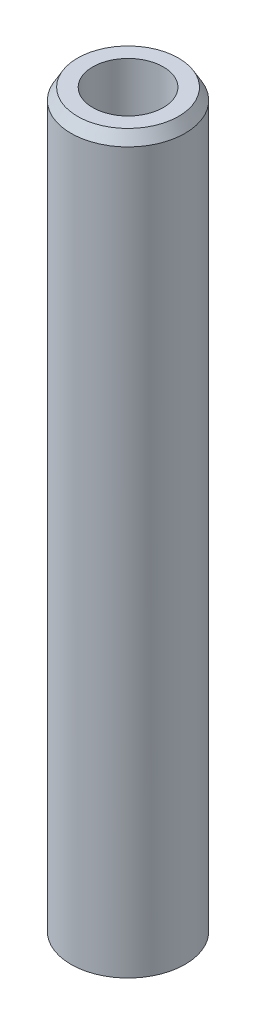
ISO-10303-21;
HEADER;
FILE_DESCRIPTION(('STEP AP214'),'2;1');
FILE_NAME('part.step','',(''),(''),'','','');
FILE_SCHEMA(('AUTOMOTIVE_DESIGN { 1 0 10303 214 1 1 1 1 }'));
ENDSEC;
DATA;
#1=APPLICATION_CONTEXT('core data for automotive mechanical design processes');
#2=APPLICATION_PROTOCOL_DEFINITION('international standard','automotive_design',2000,#1);
#3=PRODUCT_CONTEXT('',#1,'mechanical');
#4=PRODUCT('Part','Part','',(#3));
#5=PRODUCT_RELATED_PRODUCT_CATEGORY('part','',(#4));
#6=PRODUCT_DEFINITION_FORMATION('','',#4);
#7=PRODUCT_DEFINITION_CONTEXT('part definition',#1,'design');
#8=PRODUCT_DEFINITION('design','',#6,#7);
#9=PRODUCT_DEFINITION_SHAPE('','',#8);
#10=(LENGTH_UNIT() NAMED_UNIT(*) SI_UNIT(.MILLI.,.METRE.));
#11=(NAMED_UNIT(*) PLANE_ANGLE_UNIT() SI_UNIT($,.RADIAN.));
#12=(NAMED_UNIT(*) SI_UNIT($,.STERADIAN.) SOLID_ANGLE_UNIT());
#13=UNCERTAINTY_MEASURE_WITH_UNIT(LENGTH_MEASURE(1.E-05),#10,'distance_accuracy_value','');
#14=(GEOMETRIC_REPRESENTATION_CONTEXT(3) GLOBAL_UNCERTAINTY_ASSIGNED_CONTEXT((#13)) GLOBAL_UNIT_ASSIGNED_CONTEXT((#10,
#11,#12)) REPRESENTATION_CONTEXT('',''));
#15=CARTESIAN_POINT('',(0.,0.,0.));
#16=DIRECTION('',(0.,0.,1.));
#17=DIRECTION('',(1.,0.,0.));
#18=AXIS2_PLACEMENT_3D('',#15,#16,#17);
#19=CARTESIAN_POINT('',(0.,323.019459307556,0.));
#20=DIRECTION('',(0.,-1.,0.));
#21=DIRECTION('',(0.,0.,-1.));
#22=AXIS2_PLACEMENT_3D('',#19,#20,#21);
#23=CYLINDRICAL_SURFACE('',#22,25.);
#24=CARTESIAN_POINT('',(0.,318.032994780274,0.));
#25=DIRECTION('',(0.,1.,0.));
#26=DIRECTION('',(0.,0.,1.));
#27=AXIS2_PLACEMENT_3D('',#24,#25,#26);
#28=CIRCLE('',#27,25.);
#29=CARTESIAN_POINT('',(0.,318.032994780274,-25.));
#30=VERTEX_POINT('',#29);
#31=EDGE_CURVE('E50',#30,#30,#28,.F.);
#32=CARTESIAN_POINT('',(0.,2.87893663713046,0.));
#33=DIRECTION('',(0.,1.,0.));
#34=DIRECTION('',(0.,0.,1.));
#35=AXIS2_PLACEMENT_3D('',#32,#33,#34);
#36=CIRCLE('',#35,25.);
#37=CARTESIAN_POINT('',(0.,2.8789366371304,-25.));
#38=VERTEX_POINT('',#37);
#39=EDGE_CURVE('E51',#38,#38,#36,.T.);
#40=CARTESIAN_POINT('',(0.,318.032994780274,-25.));
#41=CARTESIAN_POINT('',(0.,314.75014000795,-25.));
#42=CARTESIAN_POINT('',(0.,311.467285235626,-25.));
#43=CARTESIAN_POINT('',(0.,304.901575690977,-25.));
#44=CARTESIAN_POINT('',(0.,301.618720918652,-25.));
#45=CARTESIAN_POINT('',(0.,295.053011374003,-25.));
#46=CARTESIAN_POINT('',(0.,291.770156601679,-25.));
#47=CARTESIAN_POINT('',(0.,285.20444705703,-25.));
#48=CARTESIAN_POINT('',(0.,281.921592284706,-25.));
#49=CARTESIAN_POINT('',(0.,275.355882740057,-25.));
#50=CARTESIAN_POINT('',(0.,272.073027967733,-25.));
#51=CARTESIAN_POINT('',(0.,265.507318423084,-25.));
#52=CARTESIAN_POINT('',(0.,262.224463650759,-25.));
#53=CARTESIAN_POINT('',(0.,255.65875410611,-25.));
#54=CARTESIAN_POINT('',(0.,252.375899333786,-25.));
#55=CARTESIAN_POINT('',(0.,245.810189789137,-25.));
#56=CARTESIAN_POINT('',(0.,242.527335016813,-25.));
#57=CARTESIAN_POINT('',(0.,235.961625472164,-25.));
#58=CARTESIAN_POINT('',(0.,232.67877069984,-25.));
#59=CARTESIAN_POINT('',(0.,226.113061155191,-25.));
#60=CARTESIAN_POINT('',(0.,222.830206382866,-25.));
#61=CARTESIAN_POINT('',(0.,216.264496838217,-25.));
#62=CARTESIAN_POINT('',(0.,212.981642065893,-25.));
#63=CARTESIAN_POINT('',(0.,206.415932521244,-25.));
#64=CARTESIAN_POINT('',(0.,203.13307774892,-25.));
#65=CARTESIAN_POINT('',(0.,196.567368204271,-25.));
#66=CARTESIAN_POINT('',(0.,193.284513431947,-25.));
#67=CARTESIAN_POINT('',(0.,186.718803887298,-25.));
#68=CARTESIAN_POINT('',(0.,183.435949114973,-25.));
#69=CARTESIAN_POINT('',(0.,176.870239570324,-25.));
#70=CARTESIAN_POINT('',(0.,173.587384798,-25.));
#71=CARTESIAN_POINT('',(0.,167.021675253351,-25.));
#72=CARTESIAN_POINT('',(0.,163.738820481027,-25.));
#73=CARTESIAN_POINT('',(0.,157.173110936378,-25.));
#74=CARTESIAN_POINT('',(0.,153.890256164054,-25.));
#75=CARTESIAN_POINT('',(0.,147.324546619405,-25.));
#76=CARTESIAN_POINT('',(0.,144.04169184708,-25.));
#77=CARTESIAN_POINT('',(0.,137.475982302432,-25.));
#78=CARTESIAN_POINT('',(0.,134.193127530107,-25.));
#79=CARTESIAN_POINT('',(0.,127.627417985458,-25.));
#80=CARTESIAN_POINT('',(0.,124.344563213134,-25.));
#81=CARTESIAN_POINT('',(0.,117.778853668485,-25.));
#82=CARTESIAN_POINT('',(0.,114.495998896161,-25.));
#83=CARTESIAN_POINT('',(0.,107.930289351512,-25.));
#84=CARTESIAN_POINT('',(0.,104.647434579187,-25.));
#85=CARTESIAN_POINT('',(0.,98.0817250345385,-25.));
#86=CARTESIAN_POINT('',(0.,94.7988702622141,-25.));
#87=CARTESIAN_POINT('',(0.,88.2331607175653,-25.));
#88=CARTESIAN_POINT('',(0.,84.9503059452408,-25.));
#89=CARTESIAN_POINT('',(0.,78.384596400592,-25.));
#90=CARTESIAN_POINT('',(0.,75.1017416282676,-25.));
#91=CARTESIAN_POINT('',(0.,68.5360320836187,-25.));
#92=CARTESIAN_POINT('',(0.,65.2531773112943,-25.));
#93=CARTESIAN_POINT('',(0.,58.6874677666455,-25.));
#94=CARTESIAN_POINT('',(0.,55.4046129943211,-25.));
#95=CARTESIAN_POINT('',(0.,48.8389034496723,-25.));
#96=CARTESIAN_POINT('',(0.,45.5560486773478,-25.));
#97=CARTESIAN_POINT('',(0.,38.990339132699,-25.));
#98=CARTESIAN_POINT('',(0.,35.7074843603746,-25.));
#99=CARTESIAN_POINT('',(0.,29.1417748157258,-25.));
#100=CARTESIAN_POINT('',(0.,25.8589200434014,-25.));
#101=CARTESIAN_POINT('',(0.,19.2932104987525,-25.));
#102=CARTESIAN_POINT('',(0.,16.0103557264281,-25.));
#103=CARTESIAN_POINT('',(0.,9.44464618177922,-25.));
#104=CARTESIAN_POINT('',(0.,6.16179140945481,-25.));
#105=CARTESIAN_POINT('',(0.,2.8789366371304,-25.));
#106=B_SPLINE_CURVE_WITH_KNOTS('',3,(#40,#41,#42,#43,#44,#45,#46,#47,#48,#49,#50,#51,#52,#53,
#54,#55,#56,#57,#58,#59,#60,#61,#62,#63,#64,#65,#66,#67,#68,#69,#70,#71,#72,#73,#74,#75,#76,#77,
#78,#79,#80,#81,#82,#83,#84,#85,#86,#87,#88,#89,#90,#91,#92,#93,#94,#95,#96,#97,#98,#99,#100,
#101,#102,#103,#104,#105),.UNSPECIFIED.,.F.,.F.,(4,2,2,2,2,2,2,2,2,2,2,2,2,2,2,2,2,2,2,2,2,2,2,
2,2,2,2,2,2,2,2,2,4),(0.,9.84856431697328,19.6971286339465,29.5456929509197,39.394257267893,
49.2428215848663,59.0913859018395,68.9399502188128,78.788514535786,88.6370788527593,
98.4856431697325,108.334207486706,118.182771803679,128.031336120652,137.879900437625,
147.728464754599,157.577029071572,167.425593388545,177.274157705519,187.122722022492,
196.971286339465,206.819850656438,216.668414973412,226.516979290385,236.365543607358,
246.214107924331,256.062672241305,265.911236558278,275.759800875251,285.608365192224,
295.456929509197,305.305493826171,315.154058143144),.UNSPECIFIED.);
#107=EDGE_CURVE('BSEAM39',#30,#38,#106,.T.);
#108=ORIENTED_EDGE('',*,*,#31,.T.);
#109=ORIENTED_EDGE('',*,*,#39,.T.);
#110=ORIENTED_EDGE('',*,*,#107,.T.);
#111=ORIENTED_EDGE('',*,*,#107,.F.);
#112=EDGE_LOOP('',(#108,#110,#109,#111));
#113=FACE_BOUND('',#112,.T.);
#114=ADVANCED_FACE('F39',(#113),#23,.T.);
#115=CARTESIAN_POINT('',(0.,323.019459307556,0.));
#116=DIRECTION('',(0.,1.,0.));
#117=DIRECTION('',(0.,0.,1.));
#118=AXIS2_PLACEMENT_3D('',#115,#116,#117);
#119=PLANE('',#118);
#120=CARTESIAN_POINT('',(0.,323.019459307556,0.));
#121=DIRECTION('',(0.,1.,0.));
#122=DIRECTION('',(0.,0.,1.));
#123=AXIS2_PLACEMENT_3D('',#120,#121,#122);
#124=CIRCLE('',#123,22.1210633628698);
#125=CARTESIAN_POINT('',(0.,323.019459307555,-22.1210633628698));
#126=VERTEX_POINT('',#125);
#127=EDGE_CURVE('E54',#126,#126,#124,.T.);
#128=ORIENTED_EDGE('',*,*,#127,.T.);
#129=EDGE_LOOP('',(#128));
#130=FACE_BOUND('',#129,.T.);
#131=CARTESIAN_POINT('',(0.,323.019459307556,0.));
#132=DIRECTION('',(0.,1.,0.));
#133=DIRECTION('',(0.,0.,1.));
#134=AXIS2_PLACEMENT_3D('',#131,#132,#133);
#135=CIRCLE('',#134,15.4527713364003);
#136=CARTESIAN_POINT('',(0.,323.019459307556,-15.4527713364003));
#137=VERTEX_POINT('',#136);
#138=EDGE_CURVE('E58',#137,#137,#135,.T.);
#139=ORIENTED_EDGE('',*,*,#138,.F.);
#140=EDGE_LOOP('',(#139));
#141=FACE_BOUND('',#140,.T.);
#142=ADVANCED_FACE('F69',(#130,#141),#119,.T.);
#143=CARTESIAN_POINT('',(0.,0.,0.));
#144=DIRECTION('',(0.,1.,0.));
#145=DIRECTION('',(0.,0.,1.));
#146=AXIS2_PLACEMENT_3D('',#143,#144,#145);
#147=PLANE('',#146);
#148=CARTESIAN_POINT('',(0.,0.,0.));
#149=DIRECTION('',(0.,1.,0.));
#150=DIRECTION('',(0.,0.,1.));
#151=AXIS2_PLACEMENT_3D('',#148,#149,#150);
#152=CIRCLE('',#151,20.0135354727184);
#153=CARTESIAN_POINT('',(0.,0.,20.0135354727184));
#154=VERTEX_POINT('',#153);
#155=EDGE_CURVE('E10',#154,#154,#152,.F.);
#156=ORIENTED_EDGE('',*,*,#155,.T.);
#157=EDGE_LOOP('',(#156));
#158=FACE_BOUND('',#157,.T.);
#159=CARTESIAN_POINT('',(0.,0.,0.));
#160=DIRECTION('',(0.,1.,0.));
#161=DIRECTION('',(0.,0.,1.));
#162=AXIS2_PLACEMENT_3D('',#159,#160,#161);
#163=CIRCLE('',#162,15.4527713364003);
#164=CARTESIAN_POINT('',(0.,0.,-15.4527713364003));
#165=VERTEX_POINT('',#164);
#166=EDGE_CURVE('E63',#165,#165,#163,.T.);
#167=ORIENTED_EDGE('',*,*,#166,.T.);
#168=EDGE_LOOP('',(#167));
#169=FACE_BOUND('',#168,.T.);
#170=ADVANCED_FACE('F75',(#158,#169),#147,.F.);
#171=CARTESIAN_POINT('',(0.,323.019459307556,0.));
#172=DIRECTION('',(0.,-1.,0.));
#173=DIRECTION('',(0.,0.,-1.));
#174=AXIS2_PLACEMENT_3D('',#171,#172,#173);
#175=CYLINDRICAL_SURFACE('',#174,15.4527713364003);
#176=CARTESIAN_POINT('',(0.,323.019459307556,-15.4527713364003));
#177=CARTESIAN_POINT('',(0.,319.654673273102,-15.4527713364003));
#178=CARTESIAN_POINT('',(0.,316.289887238648,-15.4527713364003));
#179=CARTESIAN_POINT('',(0.,309.560315169741,-15.4527713364003));
#180=CARTESIAN_POINT('',(0.,306.195529135287,-15.4527713364003));
#181=CARTESIAN_POINT('',(0.,299.46595706638,-15.4527713364003));
#182=CARTESIAN_POINT('',(0.,296.101171031926,-15.4527713364003));
#183=CARTESIAN_POINT('',(0.,289.371598963018,-15.4527713364003));
#184=CARTESIAN_POINT('',(0.,286.006812928565,-15.4527713364003));
#185=CARTESIAN_POINT('',(0.,279.277240859657,-15.4527713364003));
#186=CARTESIAN_POINT('',(0.,275.912454825204,-15.4527713364003));
#187=CARTESIAN_POINT('',(0.,269.182882756296,-15.4527713364003));
#188=CARTESIAN_POINT('',(0.,265.818096721843,-15.4527713364003));
#189=CARTESIAN_POINT('',(0.,259.088524652935,-15.4527713364003));
#190=CARTESIAN_POINT('',(0.,255.723738618481,-15.4527713364003));
#191=CARTESIAN_POINT('',(0.,248.994166549574,-15.4527713364003));
#192=CARTESIAN_POINT('',(0.,245.62938051512,-15.4527713364003));
#193=CARTESIAN_POINT('',(0.,238.899808446213,-15.4527713364003));
#194=CARTESIAN_POINT('',(0.,235.535022411759,-15.4527713364003));
#195=CARTESIAN_POINT('',(0.,228.805450342852,-15.4527713364003));
#196=CARTESIAN_POINT('',(0.,225.440664308398,-15.4527713364003));
#197=CARTESIAN_POINT('',(0.,218.711092239491,-15.4527713364003));
#198=CARTESIAN_POINT('',(0.,215.346306205037,-15.4527713364003));
#199=CARTESIAN_POINT('',(0.,208.61673413613,-15.4527713364003));
#200=CARTESIAN_POINT('',(0.,205.251948101676,-15.4527713364003));
#201=CARTESIAN_POINT('',(0.,198.522376032768,-15.4527713364003));
#202=CARTESIAN_POINT('',(0.,195.157589998315,-15.4527713364003));
#203=CARTESIAN_POINT('',(0.,188.428017929407,-15.4527713364003));
#204=CARTESIAN_POINT('',(0.,185.063231894954,-15.4527713364003));
#205=CARTESIAN_POINT('',(0.,178.333659826046,-15.4527713364003));
#206=CARTESIAN_POINT('',(0.,174.968873791593,-15.4527713364003));
#207=CARTESIAN_POINT('',(0.,168.239301722685,-15.4527713364003));
#208=CARTESIAN_POINT('',(0.,164.874515688231,-15.4527713364003));
#209=CARTESIAN_POINT('',(0.,158.144943619324,-15.4527713364003));
#210=CARTESIAN_POINT('',(0.,154.78015758487,-15.4527713364003));
#211=CARTESIAN_POINT('',(0.,148.050585515963,-15.4527713364003));
#212=CARTESIAN_POINT('',(0.,144.685799481509,-15.4527713364003));
#213=CARTESIAN_POINT('',(0.,137.956227412602,-15.4527713364003));
#214=CARTESIAN_POINT('',(0.,134.591441378148,-15.4527713364003));
#215=CARTESIAN_POINT('',(0.,127.861869309241,-15.4527713364003));
#216=CARTESIAN_POINT('',(0.,124.497083274787,-15.4527713364003));
#217=CARTESIAN_POINT('',(0.,117.76751120588,-15.4527713364003));
#218=CARTESIAN_POINT('',(0.,114.402725171426,-15.4527713364003));
#219=CARTESIAN_POINT('',(0.,107.673153102518,-15.4527713364003));
#220=CARTESIAN_POINT('',(0.,104.308367068065,-15.4527713364003));
#221=CARTESIAN_POINT('',(0.,97.5787949991573,-15.4527713364003));
#222=CARTESIAN_POINT('',(0.,94.2140089647036,-15.4527713364003));
#223=CARTESIAN_POINT('',(0.,87.4844368957962,-15.4527713364003));
#224=CARTESIAN_POINT('',(0.,84.1196508613425,-15.4527713364003));
#225=CARTESIAN_POINT('',(0.,77.3900787924351,-15.4527713364003));
#226=CARTESIAN_POINT('',(0.,74.0252927579814,-15.4527713364003));
#227=CARTESIAN_POINT('',(0.,67.295720689074,-15.4527713364003));
#228=CARTESIAN_POINT('',(0.,63.9309346546203,-15.4527713364003));
#229=CARTESIAN_POINT('',(0.,57.2013625857129,-15.4527713364003));
#230=CARTESIAN_POINT('',(0.,53.8365765512592,-15.4527713364003));
#231=CARTESIAN_POINT('',(0.,47.1070044823518,-15.4527713364003));
#232=CARTESIAN_POINT('',(0.,43.7422184478981,-15.4527713364003));
#233=CARTESIAN_POINT('',(0.,37.0126463789907,-15.4527713364003));
#234=CARTESIAN_POINT('',(0.,33.647860344537,-15.4527713364003));
#235=CARTESIAN_POINT('',(0.,26.9182882756296,-15.4527713364003));
#236=CARTESIAN_POINT('',(0.,23.5535022411759,-15.4527713364003));
#237=CARTESIAN_POINT('',(0.,16.8239301722685,-15.4527713364003));
#238=CARTESIAN_POINT('',(0.,13.4591441378148,-15.4527713364003));
#239=CARTESIAN_POINT('',(0.,6.72957206890736,-15.4527713364003));
#240=CARTESIAN_POINT('',(0.,3.36478603445365,-15.4527713364003));
#241=CARTESIAN_POINT('',(0.,0.,-15.4527713364003));
#242=B_SPLINE_CURVE_WITH_KNOTS('',3,(#176,#177,#178,#179,#180,#181,#182,#183,#184,#185,#186,
#187,#188,#189,#190,#191,#192,#193,#194,#195,#196,#197,#198,#199,#200,#201,#202,#203,#204,#205,
#206,#207,#208,#209,#210,#211,#212,#213,#214,#215,#216,#217,#218,#219,#220,#221,#222,#223,#224,
#225,#226,#227,#228,#229,#230,#231,#232,#233,#234,#235,#236,#237,#238,#239,#240,#241),
.UNSPECIFIED.,.F.,.F.,(4,2,2,2,2,2,2,2,2,2,2,2,2,2,2,2,2,2,2,2,2,2,2,2,2,2,2,2,2,2,2,2,4),(0.,
10.0943581033611,20.1887162067222,30.2830743100834,40.3774324134445,50.4717905168056,
60.5661486201667,70.6605067235278,80.7548648268889,90.84922293025,100.943581033611,
111.037939136972,121.132297240333,131.226655343694,141.321013447056,151.415371550417,
161.509729653778,171.604087757139,181.6984458605,191.792803963861,201.887162067222,
211.981520170583,222.075878273944,232.170236377306,242.264594480667,252.358952584028,
262.453310687389,272.54766879075,282.642026894111,292.736384997472,302.830743100833,
312.925101204194,323.019459307556),.UNSPECIFIED.);
#243=EDGE_CURVE('BSEAM70',#137,#165,#242,.T.);
#244=ORIENTED_EDGE('',*,*,#138,.T.);
#245=ORIENTED_EDGE('',*,*,#166,.F.);
#246=ORIENTED_EDGE('',*,*,#243,.T.);
#247=ORIENTED_EDGE('',*,*,#243,.F.);
#248=EDGE_LOOP('',(#244,#246,#245,#247));
#249=FACE_BOUND('',#248,.T.);
#250=ADVANCED_FACE('F70',(#249),#175,.F.);
#251=CARTESIAN_POINT('',(0.,323.019459307556,0.));
#252=DIRECTION('',(0.,-1.,0.));
#253=DIRECTION('',(0.,0.,-1.));
#254=AXIS2_PLACEMENT_3D('',#251,#252,#253);
#255=CONICAL_SURFACE('',#254,22.1210633628698,0.523598775598294);
#256=CARTESIAN_POINT('',(0.,318.032994780274,-25.));
#257=CARTESIAN_POINT('',(0.,318.0849371191,-24.9700110766966));
#258=CARTESIAN_POINT('',(0.,318.136879457926,-24.9400221533931));
#259=CARTESIAN_POINT('',(0.,318.240764135578,-24.8800443067863));
#260=CARTESIAN_POINT('',(0.,318.292706474404,-24.8500553834828));
#261=CARTESIAN_POINT('',(0.,318.396591152055,-24.7900775368759));
#262=CARTESIAN_POINT('',(0.,318.448533490881,-24.7600886135725));
#263=CARTESIAN_POINT('',(0.,318.552418168533,-24.7001107669656));
#264=CARTESIAN_POINT('',(0.,318.604360507359,-24.6701218436622));
#265=CARTESIAN_POINT('',(0.,318.70824518501,-24.6101439970553));
#266=CARTESIAN_POINT('',(0.,318.760187523836,-24.5801550737519));
#267=CARTESIAN_POINT('',(0.,318.864072201488,-24.520177227145));
#268=CARTESIAN_POINT('',(0.,318.916014540314,-24.4901883038415));
#269=CARTESIAN_POINT('',(0.,319.019899217965,-24.4302104572347));
#270=CARTESIAN_POINT('',(0.,319.071841556791,-24.4002215339312));
#271=CARTESIAN_POINT('',(0.,319.175726234443,-24.3402436873243));
#272=CARTESIAN_POINT('',(0.,319.227668573269,-24.3102547640209));
#273=CARTESIAN_POINT('',(0.,319.33155325092,-24.250276917414));
#274=CARTESIAN_POINT('',(0.,319.383495589746,-24.2202879941106));
#275=CARTESIAN_POINT('',(0.,319.487380267398,-24.1603101475037));
#276=CARTESIAN_POINT('',(0.,319.539322606224,-24.1303212242003));
#277=CARTESIAN_POINT('',(0.,319.643207283876,-24.0703433775934));
#278=CARTESIAN_POINT('',(0.,319.695149622701,-24.0403544542899));
#279=CARTESIAN_POINT('',(0.,319.799034300353,-23.9803766076831));
#280=CARTESIAN_POINT('',(0.,319.850976639179,-23.9503876843796));
#281=CARTESIAN_POINT('',(0.,319.954861316831,-23.8904098377727));
#282=CARTESIAN_POINT('',(0.,320.006803655656,-23.8604209144693));
#283=CARTESIAN_POINT('',(0.,320.110688333308,-23.8004430678624));
#284=CARTESIAN_POINT('',(0.,320.162630672134,-23.770454144559));
#285=CARTESIAN_POINT('',(0.,320.266515349786,-23.7104762979521));
#286=CARTESIAN_POINT('',(0.,320.318457688612,-23.6804873746487));
#287=CARTESIAN_POINT('',(0.,320.422342366263,-23.6205095280418));
#288=CARTESIAN_POINT('',(0.,320.474284705089,-23.5905206047383));
#289=CARTESIAN_POINT('',(0.,320.578169382741,-23.5305427581315));
#290=CARTESIAN_POINT('',(0.,320.630111721567,-23.500553834828));
#291=CARTESIAN_POINT('',(0.,320.733996399218,-23.4405759882211));
#292=CARTESIAN_POINT('',(0.,320.785938738044,-23.4105870649177));
#293=CARTESIAN_POINT('',(0.,320.889823415696,-23.3506092183108));
#294=CARTESIAN_POINT('',(0.,320.941765754522,-23.3206202950074));
#295=CARTESIAN_POINT('',(0.,321.045650432173,-23.2606424484005));
#296=CARTESIAN_POINT('',(0.,321.097592770999,-23.2306535250971));
#297=CARTESIAN_POINT('',(0.,321.201477448651,-23.1706756784902));
#298=CARTESIAN_POINT('',(0.,321.253419787477,-23.1406867551868));
#299=CARTESIAN_POINT('',(0.,321.357304465128,-23.0807089085799));
#300=CARTESIAN_POINT('',(0.,321.409246803954,-23.0507199852764));
#301=CARTESIAN_POINT('',(0.,321.513131481606,-22.9907421386695));
#302=CARTESIAN_POINT('',(0.,321.565073820432,-22.9607532153661));
#303=CARTESIAN_POINT('',(0.,321.668958498083,-22.9007753687592));
#304=CARTESIAN_POINT('',(0.,321.720900836909,-22.8707864454558));
#305=CARTESIAN_POINT('',(0.,321.824785514561,-22.8108085988489));
#306=CARTESIAN_POINT('',(0.,321.876727853387,-22.7808196755455));
#307=CARTESIAN_POINT('',(0.,321.980612531039,-22.7208418289386));
#308=CARTESIAN_POINT('',(0.,322.032554869864,-22.6908529056352));
#309=CARTESIAN_POINT('',(0.,322.136439547516,-22.6308750590283));
#310=CARTESIAN_POINT('',(0.,322.188381886342,-22.6008861357248));
#311=CARTESIAN_POINT('',(0.,322.292266563994,-22.540908289118));
#312=CARTESIAN_POINT('',(0.,322.34420890282,-22.5109193658145));
#313=CARTESIAN_POINT('',(0.,322.448093580471,-22.4509415192076));
#314=CARTESIAN_POINT('',(0.,322.500035919297,-22.4209525959042));
#315=CARTESIAN_POINT('',(0.,322.603920596949,-22.3609747492973));
#316=CARTESIAN_POINT('',(0.,322.655862935775,-22.3309858259939));
#317=CARTESIAN_POINT('',(0.,322.759747613426,-22.271007979387));
#318=CARTESIAN_POINT('',(0.,322.811689952252,-22.2410190560836));
#319=CARTESIAN_POINT('',(0.,322.915574629904,-22.1810412094767));
#320=CARTESIAN_POINT('',(0.,322.96751696873,-22.1510522861732));
#321=CARTESIAN_POINT('',(0.,323.019459307556,-22.1210633628698));
#322=B_SPLINE_CURVE_WITH_KNOTS('',3,(#256,#257,#258,#259,#260,#261,#262,#263,#264,#265,#266,
#267,#268,#269,#270,#271,#272,#273,#274,#275,#276,#277,#278,#279,#280,#281,#282,#283,#284,#285,
#286,#287,#288,#289,#290,#291,#292,#293,#294,#295,#296,#297,#298,#299,#300,#301,#302,#303,#304,
#305,#306,#307,#308,#309,#310,#311,#312,#313,#314,#315,#316,#317,#318,#319,#320,#321),
.UNSPECIFIED.,.F.,.F.,(4,2,2,2,2,2,2,2,2,2,2,2,2,2,2,2,2,2,2,2,2,2,2,2,2,2,2,2,2,2,2,2,4),(0.,
0.179933539820597,0.359867079641242,0.539800619461887,0.719734159282531,0.899667699103176,
1.07960123892382,1.25953477874446,1.43946831856511,1.61940185838575,1.7993353982064,
1.979268938027,2.15920247784764,2.33913601766828,2.51906955748893,2.69900309730957,
2.87893663713022,3.05887017695086,3.23880371677151,3.41873725659215,3.5986707964128,
3.77860433623344,3.95853787605404,4.13847141587468,4.31840495569533,4.49833849551597,
4.67827203533662,4.85820557515726,5.03813911497791,5.21807265479855,5.3980061946192,
5.57793973443984,5.75787327426049),.UNSPECIFIED.);
#323=EDGE_CURVE('BSEAM81',#30,#126,#322,.T.);
#324=ORIENTED_EDGE('',*,*,#31,.F.);
#325=ORIENTED_EDGE('',*,*,#127,.F.);
#326=ORIENTED_EDGE('',*,*,#323,.T.);
#327=ORIENTED_EDGE('',*,*,#323,.F.);
#328=EDGE_LOOP('',(#324,#326,#325,#327));
#329=FACE_BOUND('',#328,.T.);
#330=ADVANCED_FACE('F81',(#329),#255,.T.);
#331=CARTESIAN_POINT('',(0.,2.87893663713046,0.));
#332=DIRECTION('',(0.,1.,0.));
#333=DIRECTION('',(0.,0.,1.));
#334=AXIS2_PLACEMENT_3D('',#331,#332,#333);
#335=CONICAL_SURFACE('',#334,25.,1.04719755119661);
#336=ORIENTED_EDGE('',*,*,#155,.F.);
#337=EDGE_LOOP('',(#336));
#338=FACE_BOUND('',#337,.T.);
#339=ORIENTED_EDGE('',*,*,#39,.F.);
#340=EDGE_LOOP('',(#339));
#341=FACE_BOUND('',#340,.T.);
#342=ADVANCED_FACE('F45',(#338,#341),#335,.T.);
#343=CLOSED_SHELL('',(#114,#142,#170,#250,#330,#342));
#344=MANIFOLD_SOLID_BREP('B2',#343);
#345=ADVANCED_BREP_SHAPE_REPRESENTATION('',(#18,#344),#14);
#346=SHAPE_DEFINITION_REPRESENTATION(#9,#345);
ENDSEC;
END-ISO-10303-21;
